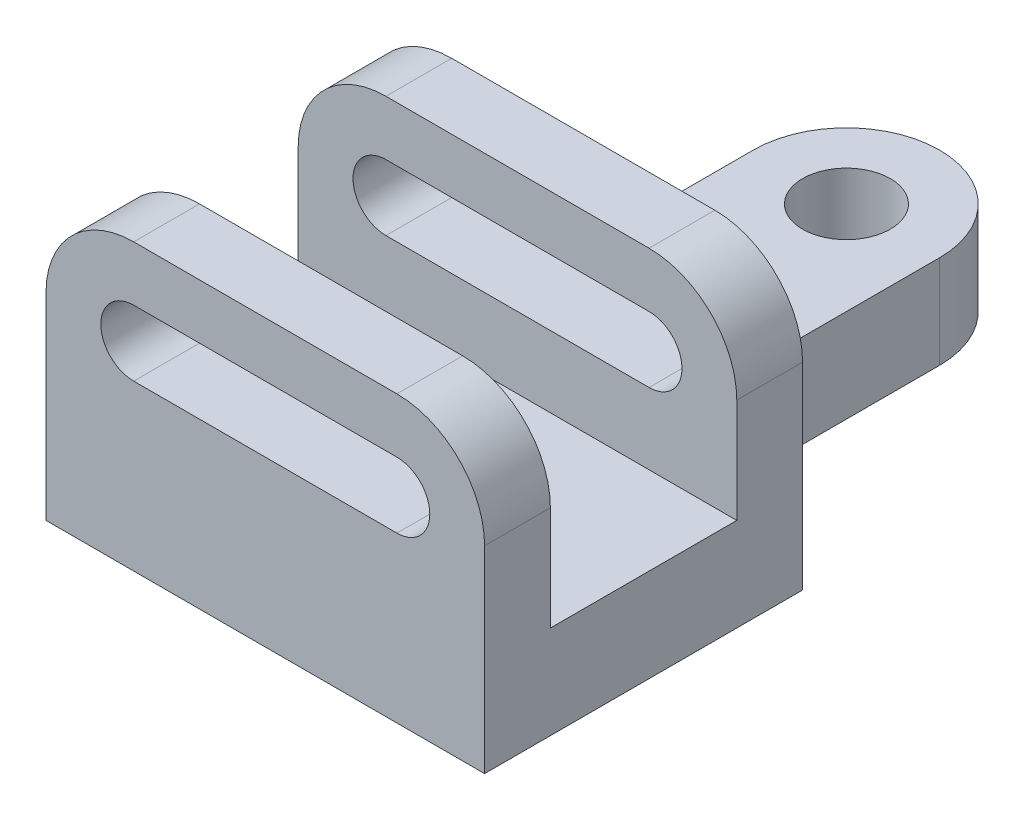
ISO-10303-21;
HEADER;
FILE_DESCRIPTION(('STEP AP214'),'2;1');
FILE_NAME('part.step','',(''),(''),'','','');
FILE_SCHEMA(('AUTOMOTIVE_DESIGN { 1 0 10303 214 1 1 1 1 }'));
ENDSEC;
DATA;
#1=APPLICATION_CONTEXT('core data for automotive mechanical design processes');
#2=APPLICATION_PROTOCOL_DEFINITION('international standard','automotive_design',2000,#1);
#3=PRODUCT_CONTEXT('',#1,'mechanical');
#4=PRODUCT('Part','Part','',(#3));
#5=PRODUCT_RELATED_PRODUCT_CATEGORY('part','',(#4));
#6=PRODUCT_DEFINITION_FORMATION('','',#4);
#7=PRODUCT_DEFINITION_CONTEXT('part definition',#1,'design');
#8=PRODUCT_DEFINITION('design','',#6,#7);
#9=PRODUCT_DEFINITION_SHAPE('','',#8);
#10=(LENGTH_UNIT() NAMED_UNIT(*) SI_UNIT(.MILLI.,.METRE.));
#11=(NAMED_UNIT(*) PLANE_ANGLE_UNIT() SI_UNIT($,.RADIAN.));
#12=(NAMED_UNIT(*) SI_UNIT($,.STERADIAN.) SOLID_ANGLE_UNIT());
#13=UNCERTAINTY_MEASURE_WITH_UNIT(LENGTH_MEASURE(1.E-05),#10,'distance_accuracy_value','');
#14=(GEOMETRIC_REPRESENTATION_CONTEXT(3) GLOBAL_UNCERTAINTY_ASSIGNED_CONTEXT((#13)) GLOBAL_UNIT_ASSIGNED_CONTEXT((#10,
#11,#12)) REPRESENTATION_CONTEXT('',''));
#15=CARTESIAN_POINT('',(0.,0.,0.));
#16=DIRECTION('',(0.,0.,1.));
#17=DIRECTION('',(1.,0.,0.));
#18=AXIS2_PLACEMENT_3D('',#15,#16,#17);
#19=CARTESIAN_POINT('',(-24.,0.,29.));
#20=DIRECTION('',(0.,0.,-1.));
#21=DIRECTION('',(-1.,0.,0.));
#22=AXIS2_PLACEMENT_3D('',#19,#20,#21);
#23=CYLINDRICAL_SURFACE('',#22,16.);
#24=DIRECTION('',(0.,0.,-1.));
#25=VECTOR('',#24,1.);
#26=CARTESIAN_POINT('',(-24.,16.,29.));
#27=LINE('',#26,#25);
#28=CARTESIAN_POINT('',(-24.,16.,29.));
#29=VERTEX_POINT('',#28);
#30=CARTESIAN_POINT('',(-24.,16.,17.));
#31=VERTEX_POINT('',#30);
#32=EDGE_CURVE('E379',#29,#31,#27,.T.);
#33=ORIENTED_EDGE('',*,*,#32,.T.);
#34=CARTESIAN_POINT('',(-24.,0.,17.));
#35=DIRECTION('',(0.,0.,1.));
#36=DIRECTION('',(0.,-1.,0.));
#37=AXIS2_PLACEMENT_3D('',#34,#35,#36);
#38=CIRCLE('',#37,16.);
#39=CARTESIAN_POINT('',(-40.,0.,17.));
#40=VERTEX_POINT('',#39);
#41=EDGE_CURVE('E307',#31,#40,#38,.T.);
#42=ORIENTED_EDGE('',*,*,#41,.T.);
#43=DIRECTION('',(0.,0.,-1.));
#44=VECTOR('',#43,1.);
#45=CARTESIAN_POINT('',(-40.,0.,29.));
#46=LINE('',#45,#44);
#47=CARTESIAN_POINT('',(-40.,0.,29.));
#48=VERTEX_POINT('',#47);
#49=EDGE_CURVE('E397',#48,#40,#46,.T.);
#50=ORIENTED_EDGE('',*,*,#49,.F.);
#51=CARTESIAN_POINT('',(-24.,0.,29.));
#52=DIRECTION('',(0.,0.,1.));
#53=DIRECTION('',(-1.,0.,0.));
#54=AXIS2_PLACEMENT_3D('',#51,#52,#53);
#55=CIRCLE('',#54,16.);
#56=EDGE_CURVE('E348',#29,#48,#55,.T.);
#57=ORIENTED_EDGE('',*,*,#56,.F.);
#58=EDGE_LOOP('',(#33,#42,#50,#57));
#59=FACE_BOUND('',#58,.T.);
#60=ADVANCED_FACE('F33',(#59),#23,.T.);
#61=CARTESIAN_POINT('',(24.,0.,29.));
#62=DIRECTION('',(0.,0.,-1.));
#63=DIRECTION('',(-1.,0.,0.));
#64=AXIS2_PLACEMENT_3D('',#61,#62,#63);
#65=CYLINDRICAL_SURFACE('',#64,16.);
#66=DIRECTION('',(0.,0.,-1.));
#67=VECTOR('',#66,1.);
#68=CARTESIAN_POINT('',(40.,0.,29.));
#69=LINE('',#68,#67);
#70=CARTESIAN_POINT('',(40.,0.,29.));
#71=VERTEX_POINT('',#70);
#72=CARTESIAN_POINT('',(40.,0.,17.));
#73=VERTEX_POINT('',#72);
#74=EDGE_CURVE('E387',#71,#73,#69,.T.);
#75=ORIENTED_EDGE('',*,*,#74,.T.);
#76=CARTESIAN_POINT('',(24.,0.,17.));
#77=DIRECTION('',(0.,0.,1.));
#78=DIRECTION('',(0.,-1.,0.));
#79=AXIS2_PLACEMENT_3D('',#76,#77,#78);
#80=CIRCLE('',#79,16.);
#81=CARTESIAN_POINT('',(24.,16.,17.));
#82=VERTEX_POINT('',#81);
#83=EDGE_CURVE('E304',#73,#82,#80,.T.);
#84=ORIENTED_EDGE('',*,*,#83,.T.);
#85=DIRECTION('',(0.,0.,-1.));
#86=VECTOR('',#85,1.);
#87=CARTESIAN_POINT('',(24.,16.,29.));
#88=LINE('',#87,#86);
#89=CARTESIAN_POINT('',(24.,16.,29.));
#90=VERTEX_POINT('',#89);
#91=EDGE_CURVE('E383',#90,#82,#88,.T.);
#92=ORIENTED_EDGE('',*,*,#91,.F.);
#93=CARTESIAN_POINT('',(24.,0.,29.));
#94=DIRECTION('',(0.,0.,1.));
#95=DIRECTION('',(1.,0.,0.));
#96=AXIS2_PLACEMENT_3D('',#93,#94,#95);
#97=CIRCLE('',#96,16.);
#98=EDGE_CURVE('E358',#71,#90,#97,.T.);
#99=ORIENTED_EDGE('',*,*,#98,.F.);
#100=EDGE_LOOP('',(#75,#84,#92,#99));
#101=FACE_BOUND('',#100,.T.);
#102=ADVANCED_FACE('F441',(#101),#65,.T.);
#103=CARTESIAN_POINT('',(-24.,16.,29.));
#104=DIRECTION('',(0.,-1.,0.));
#105=DIRECTION('',(1.,0.,0.));
#106=AXIS2_PLACEMENT_3D('',#103,#104,#105);
#107=PLANE('',#106);
#108=ORIENTED_EDGE('',*,*,#91,.T.);
#109=DIRECTION('',(1.,0.,0.));
#110=VECTOR('',#109,1.);
#111=CARTESIAN_POINT('',(-40.,16.,17.));
#112=LINE('',#111,#110);
#113=EDGE_CURVE('E280',#31,#82,#112,.T.);
#114=ORIENTED_EDGE('',*,*,#113,.F.);
#115=ORIENTED_EDGE('',*,*,#32,.F.);
#116=DIRECTION('',(-1.,0.,0.));
#117=VECTOR('',#116,1.);
#118=CARTESIAN_POINT('',(-24.,16.,29.));
#119=LINE('',#118,#117);
#120=EDGE_CURVE('E360',#90,#29,#119,.T.);
#121=ORIENTED_EDGE('',*,*,#120,.F.);
#122=EDGE_LOOP('',(#108,#114,#115,#121));
#123=FACE_BOUND('',#122,.T.);
#124=ADVANCED_FACE('F436',(#123),#107,.F.);
#125=CARTESIAN_POINT('',(-24.,0.,29.));
#126=DIRECTION('',(0.,0.,-1.));
#127=DIRECTION('',(-1.,0.,0.));
#128=AXIS2_PLACEMENT_3D('',#125,#126,#127);
#129=CYLINDRICAL_SURFACE('',#128,6.);
#130=CARTESIAN_POINT('',(-24.,0.,17.));
#131=DIRECTION('',(0.,0.,1.));
#132=DIRECTION('',(0.,-1.,0.));
#133=AXIS2_PLACEMENT_3D('',#130,#131,#132);
#134=CIRCLE('',#133,6.);
#135=CARTESIAN_POINT('',(-24.,6.,17.));
#136=VERTEX_POINT('',#135);
#137=CARTESIAN_POINT('',(-24.,-6.,17.));
#138=VERTEX_POINT('',#137);
#139=EDGE_CURVE('E302',#136,#138,#134,.T.);
#140=ORIENTED_EDGE('',*,*,#139,.F.);
#141=DIRECTION('',(0.,0.,-1.));
#142=VECTOR('',#141,1.);
#143=CARTESIAN_POINT('',(-24.,6.,29.));
#144=LINE('',#143,#142);
#145=CARTESIAN_POINT('',(-24.,6.,29.));
#146=VERTEX_POINT('',#145);
#147=EDGE_CURVE('E332',#146,#136,#144,.T.);
#148=ORIENTED_EDGE('',*,*,#147,.F.);
#149=CARTESIAN_POINT('',(-24.,0.,29.));
#150=DIRECTION('',(0.,0.,1.));
#151=DIRECTION('',(1.,0.,0.));
#152=AXIS2_PLACEMENT_3D('',#149,#150,#151);
#153=CIRCLE('',#152,6.);
#154=CARTESIAN_POINT('',(-24.,-6.,29.));
#155=VERTEX_POINT('',#154);
#156=EDGE_CURVE('E311',#146,#155,#153,.T.);
#157=ORIENTED_EDGE('',*,*,#156,.T.);
#158=DIRECTION('',(0.,0.,-1.));
#159=VECTOR('',#158,1.);
#160=CARTESIAN_POINT('',(-24.,-6.,29.));
#161=LINE('',#160,#159);
#162=EDGE_CURVE('E344',#155,#138,#161,.T.);
#163=ORIENTED_EDGE('',*,*,#162,.T.);
#164=EDGE_LOOP('',(#140,#148,#157,#163));
#165=FACE_BOUND('',#164,.T.);
#166=ADVANCED_FACE('F426',(#165),#129,.F.);
#167=CARTESIAN_POINT('',(-24.,-6.,29.));
#168=DIRECTION('',(0.,1.,0.));
#169=DIRECTION('',(0.,0.,1.));
#170=AXIS2_PLACEMENT_3D('',#167,#168,#169);
#171=PLANE('',#170);
#172=DIRECTION('',(1.,0.,0.));
#173=VECTOR('',#172,1.);
#174=CARTESIAN_POINT('',(-24.,-6.,17.));
#175=LINE('',#174,#173);
#176=CARTESIAN_POINT('',(24.,-6.,17.));
#177=VERTEX_POINT('',#176);
#178=EDGE_CURVE('E300',#138,#177,#175,.T.);
#179=ORIENTED_EDGE('',*,*,#178,.F.);
#180=ORIENTED_EDGE('',*,*,#162,.F.);
#181=DIRECTION('',(1.,0.,0.));
#182=VECTOR('',#181,1.);
#183=CARTESIAN_POINT('',(-24.,-6.,29.));
#184=LINE('',#183,#182);
#185=CARTESIAN_POINT('',(24.,-6.,29.));
#186=VERTEX_POINT('',#185);
#187=EDGE_CURVE('E313',#155,#186,#184,.T.);
#188=ORIENTED_EDGE('',*,*,#187,.T.);
#189=DIRECTION('',(0.,0.,-1.));
#190=VECTOR('',#189,1.);
#191=CARTESIAN_POINT('',(24.,-6.,29.));
#192=LINE('',#191,#190);
#193=EDGE_CURVE('E340',#186,#177,#192,.T.);
#194=ORIENTED_EDGE('',*,*,#193,.T.);
#195=EDGE_LOOP('',(#179,#180,#188,#194));
#196=FACE_BOUND('',#195,.T.);
#197=ADVANCED_FACE('F432',(#196),#171,.T.);
#198=CARTESIAN_POINT('',(24.,0.,29.));
#199=DIRECTION('',(0.,0.,-1.));
#200=DIRECTION('',(-1.,0.,0.));
#201=AXIS2_PLACEMENT_3D('',#198,#199,#200);
#202=CYLINDRICAL_SURFACE('',#201,6.);
#203=CARTESIAN_POINT('',(24.,0.,17.));
#204=DIRECTION('',(0.,0.,1.));
#205=DIRECTION('',(0.,-1.,0.));
#206=AXIS2_PLACEMENT_3D('',#203,#204,#205);
#207=CIRCLE('',#206,6.);
#208=CARTESIAN_POINT('',(24.,6.,17.));
#209=VERTEX_POINT('',#208);
#210=EDGE_CURVE('E298',#177,#209,#207,.T.);
#211=ORIENTED_EDGE('',*,*,#210,.F.);
#212=ORIENTED_EDGE('',*,*,#193,.F.);
#213=CARTESIAN_POINT('',(24.,0.,29.));
#214=DIRECTION('',(0.,0.,1.));
#215=DIRECTION('',(1.,0.,0.));
#216=AXIS2_PLACEMENT_3D('',#213,#214,#215);
#217=CIRCLE('',#216,6.);
#218=CARTESIAN_POINT('',(24.,6.,29.));
#219=VERTEX_POINT('',#218);
#220=EDGE_CURVE('E316',#186,#219,#217,.T.);
#221=ORIENTED_EDGE('',*,*,#220,.T.);
#222=DIRECTION('',(0.,0.,-1.));
#223=VECTOR('',#222,1.);
#224=CARTESIAN_POINT('',(24.,6.,29.));
#225=LINE('',#224,#223);
#226=EDGE_CURVE('E336',#219,#209,#225,.T.);
#227=ORIENTED_EDGE('',*,*,#226,.T.);
#228=EDGE_LOOP('',(#211,#212,#221,#227));
#229=FACE_BOUND('',#228,.T.);
#230=ADVANCED_FACE('F533',(#229),#202,.F.);
#231=CARTESIAN_POINT('',(-24.,6.,29.));
#232=DIRECTION('',(0.,-1.,0.));
#233=DIRECTION('',(0.,0.,-1.));
#234=AXIS2_PLACEMENT_3D('',#231,#232,#233);
#235=PLANE('',#234);
#236=DIRECTION('',(-1.,0.,0.));
#237=VECTOR('',#236,1.);
#238=CARTESIAN_POINT('',(-24.,6.,17.));
#239=LINE('',#238,#237);
#240=EDGE_CURVE('E11',#209,#136,#239,.T.);
#241=ORIENTED_EDGE('',*,*,#240,.F.);
#242=ORIENTED_EDGE('',*,*,#226,.F.);
#243=DIRECTION('',(-1.,0.,0.));
#244=VECTOR('',#243,1.);
#245=CARTESIAN_POINT('',(-24.,6.,29.));
#246=LINE('',#245,#244);
#247=EDGE_CURVE('E319',#219,#146,#246,.T.);
#248=ORIENTED_EDGE('',*,*,#247,.T.);
#249=ORIENTED_EDGE('',*,*,#147,.T.);
#250=EDGE_LOOP('',(#241,#242,#248,#249));
#251=FACE_BOUND('',#250,.T.);
#252=ADVANCED_FACE('F531',(#251),#235,.T.);
#253=CARTESIAN_POINT('',(-24.,0.,29.));
#254=DIRECTION('',(0.,0.,-1.));
#255=DIRECTION('',(-1.,0.,0.));
#256=AXIS2_PLACEMENT_3D('',#253,#254,#255);
#257=PLANE('',#256);
#258=ORIENTED_EDGE('',*,*,#56,.T.);
#259=DIRECTION('',(0.,-1.,0.));
#260=VECTOR('',#259,1.);
#261=CARTESIAN_POINT('',(-40.,0.,29.));
#262=LINE('',#261,#260);
#263=CARTESIAN_POINT('',(-40.,-36.,29.));
#264=VERTEX_POINT('',#263);
#265=EDGE_CURVE('E351',#48,#264,#262,.T.);
#266=ORIENTED_EDGE('',*,*,#265,.T.);
#267=DIRECTION('',(1.,0.,0.));
#268=VECTOR('',#267,1.);
#269=CARTESIAN_POINT('',(-40.,-36.,29.));
#270=LINE('',#269,#268);
#271=CARTESIAN_POINT('',(40.,-36.,29.));
#272=VERTEX_POINT('',#271);
#273=EDGE_CURVE('E354',#264,#272,#270,.T.);
#274=ORIENTED_EDGE('',*,*,#273,.T.);
#275=DIRECTION('',(0.,1.,0.));
#276=VECTOR('',#275,1.);
#277=CARTESIAN_POINT('',(40.,-36.,29.));
#278=LINE('',#277,#276);
#279=EDGE_CURVE('E356',#272,#71,#278,.T.);
#280=ORIENTED_EDGE('',*,*,#279,.T.);
#281=ORIENTED_EDGE('',*,*,#98,.T.);
#282=ORIENTED_EDGE('',*,*,#120,.T.);
#283=EDGE_LOOP('',(#258,#266,#274,#280,#281,#282));
#284=FACE_BOUND('',#283,.T.);
#285=ORIENTED_EDGE('',*,*,#156,.F.);
#286=ORIENTED_EDGE('',*,*,#247,.F.);
#287=ORIENTED_EDGE('',*,*,#220,.F.);
#288=ORIENTED_EDGE('',*,*,#187,.F.);
#289=EDGE_LOOP('',(#285,#286,#287,#288));
#290=FACE_BOUND('',#289,.T.);
#291=ADVANCED_FACE('F457',(#284,#290),#257,.F.);
#292=CARTESIAN_POINT('',(-24.,0.,-29.));
#293=DIRECTION('',(0.,0.,-1.));
#294=DIRECTION('',(-1.,0.,0.));
#295=AXIS2_PLACEMENT_3D('',#292,#293,#294);
#296=PLANE('',#295);
#297=DIRECTION('',(0.,-1.,0.));
#298=VECTOR('',#297,1.);
#299=CARTESIAN_POINT('',(-33.0000000000001,-19.,-29.));
#300=LINE('',#299,#298);
#301=CARTESIAN_POINT('',(-33.0000000000001,-19.,-29.));
#302=VERTEX_POINT('',#301);
#303=CARTESIAN_POINT('',(-33.0000000000001,-36.,-29.));
#304=VERTEX_POINT('',#303);
#305=EDGE_CURVE('E258',#302,#304,#300,.T.);
#306=ORIENTED_EDGE('',*,*,#305,.T.);
#307=DIRECTION('',(1.,0.,0.));
#308=VECTOR('',#307,1.);
#309=CARTESIAN_POINT('',(-40.,-36.,-29.));
#310=LINE('',#309,#308);
#311=CARTESIAN_POINT('',(-40.,-36.,-29.));
#312=VERTEX_POINT('',#311);
#313=EDGE_CURVE('E368',#312,#304,#310,.T.);
#314=ORIENTED_EDGE('',*,*,#313,.F.);
#315=DIRECTION('',(0.,-1.,0.));
#316=VECTOR('',#315,1.);
#317=CARTESIAN_POINT('',(-40.,0.,-29.));
#318=LINE('',#317,#316);
#319=CARTESIAN_POINT('',(-40.,0.,-29.));
#320=VERTEX_POINT('',#319);
#321=EDGE_CURVE('E365',#320,#312,#318,.T.);
#322=ORIENTED_EDGE('',*,*,#321,.F.);
#323=CARTESIAN_POINT('',(-24.,0.,-29.));
#324=DIRECTION('',(0.,0.,1.));
#325=DIRECTION('',(-1.,0.,0.));
#326=AXIS2_PLACEMENT_3D('',#323,#324,#325);
#327=CIRCLE('',#326,16.);
#328=CARTESIAN_POINT('',(-24.,16.,-29.));
#329=VERTEX_POINT('',#328);
#330=EDGE_CURVE('E347',#329,#320,#327,.T.);
#331=ORIENTED_EDGE('',*,*,#330,.F.);
#332=DIRECTION('',(-1.,0.,0.));
#333=VECTOR('',#332,1.);
#334=CARTESIAN_POINT('',(-24.,16.,-29.));
#335=LINE('',#334,#333);
#336=CARTESIAN_POINT('',(24.,16.,-29.));
#337=VERTEX_POINT('',#336);
#338=EDGE_CURVE('E352',#337,#329,#335,.T.);
#339=ORIENTED_EDGE('',*,*,#338,.F.);
#340=CARTESIAN_POINT('',(24.,0.,-29.));
#341=DIRECTION('',(0.,0.,1.));
#342=DIRECTION('',(1.,0.,0.));
#343=AXIS2_PLACEMENT_3D('',#340,#341,#342);
#344=CIRCLE('',#343,16.);
#345=CARTESIAN_POINT('',(40.,0.,-29.));
#346=VERTEX_POINT('',#345);
#347=EDGE_CURVE('E374',#346,#337,#344,.T.);
#348=ORIENTED_EDGE('',*,*,#347,.F.);
#349=DIRECTION('',(0.,1.,0.));
#350=VECTOR('',#349,1.);
#351=CARTESIAN_POINT('',(40.,-36.,-29.));
#352=LINE('',#351,#350);
#353=CARTESIAN_POINT('',(40.,-36.,-29.));
#354=VERTEX_POINT('',#353);
#355=EDGE_CURVE('E371',#354,#346,#352,.T.);
#356=ORIENTED_EDGE('',*,*,#355,.F.);
#357=CARTESIAN_POINT('',(33.,-36.,-29.));
#358=VERTEX_POINT('',#357);
#359=EDGE_CURVE('E367',#358,#354,#310,.T.);
#360=ORIENTED_EDGE('',*,*,#359,.F.);
#361=DIRECTION('',(0.,-1.,0.));
#362=VECTOR('',#361,1.);
#363=CARTESIAN_POINT('',(33.0000000000001,-19.,-29.));
#364=LINE('',#363,#362);
#365=CARTESIAN_POINT('',(33.0000000000001,-19.,-29.));
#366=VERTEX_POINT('',#365);
#367=EDGE_CURVE('E261',#366,#358,#364,.T.);
#368=ORIENTED_EDGE('',*,*,#367,.F.);
#369=DIRECTION('',(-1.,0.,0.));
#370=VECTOR('',#369,1.);
#371=CARTESIAN_POINT('',(-33.0000000000001,-19.,-29.));
#372=LINE('',#371,#370);
#373=EDGE_CURVE('E240',#366,#302,#372,.T.);
#374=ORIENTED_EDGE('',*,*,#373,.T.);
#375=EDGE_LOOP('',(#306,#314,#322,#331,#339,#348,#356,#360,#368,#374));
#376=FACE_BOUND('',#375,.T.);
#377=DIRECTION('',(-1.,0.,0.));
#378=VECTOR('',#377,1.);
#379=CARTESIAN_POINT('',(-24.,6.,-29.));
#380=LINE('',#379,#378);
#381=CARTESIAN_POINT('',(24.,6.,-29.));
#382=VERTEX_POINT('',#381);
#383=CARTESIAN_POINT('',(-24.,6.,-29.));
#384=VERTEX_POINT('',#383);
#385=EDGE_CURVE('E314',#382,#384,#380,.T.);
#386=ORIENTED_EDGE('',*,*,#385,.T.);
#387=CARTESIAN_POINT('',(-24.,0.,-29.));
#388=DIRECTION('',(0.,0.,1.));
#389=DIRECTION('',(1.,0.,0.));
#390=AXIS2_PLACEMENT_3D('',#387,#388,#389);
#391=CIRCLE('',#390,6.);
#392=CARTESIAN_POINT('',(-24.,-6.,-29.));
#393=VERTEX_POINT('',#392);
#394=EDGE_CURVE('E310',#384,#393,#391,.T.);
#395=ORIENTED_EDGE('',*,*,#394,.T.);
#396=DIRECTION('',(1.,0.,0.));
#397=VECTOR('',#396,1.);
#398=CARTESIAN_POINT('',(-24.,-6.,-29.));
#399=LINE('',#398,#397);
#400=CARTESIAN_POINT('',(24.,-6.,-29.));
#401=VERTEX_POINT('',#400);
#402=EDGE_CURVE('E324',#393,#401,#399,.T.);
#403=ORIENTED_EDGE('',*,*,#402,.T.);
#404=CARTESIAN_POINT('',(24.,0.,-29.));
#405=DIRECTION('',(0.,0.,1.));
#406=DIRECTION('',(1.,0.,0.));
#407=AXIS2_PLACEMENT_3D('',#404,#405,#406);
#408=CIRCLE('',#407,6.);
#409=EDGE_CURVE('E327',#401,#382,#408,.T.);
#410=ORIENTED_EDGE('',*,*,#409,.T.);
#411=EDGE_LOOP('',(#386,#395,#403,#410));
#412=FACE_BOUND('',#411,.T.);
#413=ADVANCED_FACE('F416',(#376,#412),#296,.T.);
#414=CARTESIAN_POINT('',(-40.,0.,-17.));
#415=VERTEX_POINT('',#414);
#416=EDGE_CURVE('E396',#415,#320,#46,.T.);
#417=ORIENTED_EDGE('',*,*,#416,.F.);
#418=CARTESIAN_POINT('',(-24.,0.,-17.));
#419=DIRECTION('',(0.,0.,-1.));
#420=DIRECTION('',(0.,1.,0.));
#421=AXIS2_PLACEMENT_3D('',#418,#419,#420);
#422=CIRCLE('',#421,16.);
#423=CARTESIAN_POINT('',(-24.,16.,-17.));
#424=VERTEX_POINT('',#423);
#425=EDGE_CURVE('E295',#415,#424,#422,.T.);
#426=ORIENTED_EDGE('',*,*,#425,.T.);
#427=EDGE_CURVE('E362',#424,#329,#27,.T.);
#428=ORIENTED_EDGE('',*,*,#427,.T.);
#429=ORIENTED_EDGE('',*,*,#330,.T.);
#430=EDGE_LOOP('',(#417,#426,#428,#429));
#431=FACE_BOUND('',#430,.T.);
#432=ADVANCED_FACE('F35',(#431),#23,.T.);
#433=CARTESIAN_POINT('',(-40.,0.,29.));
#434=DIRECTION('',(1.,0.,0.));
#435=DIRECTION('',(0.,0.,-1.));
#436=AXIS2_PLACEMENT_3D('',#433,#434,#435);
#437=PLANE('',#436);
#438=ORIENTED_EDGE('',*,*,#49,.T.);
#439=DIRECTION('',(0.,-1.,0.));
#440=VECTOR('',#439,1.);
#441=CARTESIAN_POINT('',(-40.,16.,17.));
#442=LINE('',#441,#440);
#443=CARTESIAN_POINT('',(-40.,-19.,17.));
#444=VERTEX_POINT('',#443);
#445=EDGE_CURVE('E270',#40,#444,#442,.T.);
#446=ORIENTED_EDGE('',*,*,#445,.T.);
#447=DIRECTION('',(0.,0.,-1.));
#448=VECTOR('',#447,1.);
#449=CARTESIAN_POINT('',(-40.,-19.,17.));
#450=LINE('',#449,#448);
#451=CARTESIAN_POINT('',(-40.,-19.,-17.));
#452=VERTEX_POINT('',#451);
#453=EDGE_CURVE('E273',#444,#452,#450,.T.);
#454=ORIENTED_EDGE('',*,*,#453,.T.);
#455=DIRECTION('',(0.,1.,0.));
#456=VECTOR('',#455,1.);
#457=CARTESIAN_POINT('',(-40.,16.,-17.));
#458=LINE('',#457,#456);
#459=EDGE_CURVE('E276',#452,#415,#458,.T.);
#460=ORIENTED_EDGE('',*,*,#459,.T.);
#461=ORIENTED_EDGE('',*,*,#416,.T.);
#462=ORIENTED_EDGE('',*,*,#321,.T.);
#463=DIRECTION('',(0.,0.,-1.));
#464=VECTOR('',#463,1.);
#465=CARTESIAN_POINT('',(-40.,-36.,29.));
#466=LINE('',#465,#464);
#467=EDGE_CURVE('E393',#264,#312,#466,.T.);
#468=ORIENTED_EDGE('',*,*,#467,.F.);
#469=ORIENTED_EDGE('',*,*,#265,.F.);
#470=EDGE_LOOP('',(#438,#446,#454,#460,#461,#462,#468,#469));
#471=FACE_BOUND('',#470,.T.);
#472=ADVANCED_FACE('F449',(#471),#437,.F.);
#473=CARTESIAN_POINT('',(-40.,-36.,29.));
#474=DIRECTION('',(0.,1.,0.));
#475=DIRECTION('',(0.,0.,1.));
#476=AXIS2_PLACEMENT_3D('',#473,#474,#475);
#477=PLANE('',#476);
#478=ORIENTED_EDGE('',*,*,#313,.T.);
#479=CARTESIAN_POINT('',(-33.,-36.,-45.));
#480=DIRECTION('',(0.,1.,0.));
#481=DIRECTION('',(0.,0.,-1.));
#482=AXIS2_PLACEMENT_3D('',#479,#480,#481);
#483=CIRCLE('',#482,16.);
#484=CARTESIAN_POINT('',(-17.,-36.,-45.0000000000001));
#485=VERTEX_POINT('',#484);
#486=EDGE_CURVE('E233',#304,#485,#483,.T.);
#487=ORIENTED_EDGE('',*,*,#486,.T.);
#488=DIRECTION('',(0.,0.,-1.));
#489=VECTOR('',#488,1.);
#490=CARTESIAN_POINT('',(-17.,-36.,-77.));
#491=LINE('',#490,#489);
#492=CARTESIAN_POINT('',(-17.,-36.,-77.));
#493=VERTEX_POINT('',#492);
#494=EDGE_CURVE('E230',#485,#493,#491,.T.);
#495=ORIENTED_EDGE('',*,*,#494,.T.);
#496=CARTESIAN_POINT('',(0.,-36.,-77.));
#497=DIRECTION('',(0.,-1.,0.));
#498=DIRECTION('',(0.,0.,-1.));
#499=AXIS2_PLACEMENT_3D('',#496,#497,#498);
#500=CIRCLE('',#499,17.);
#501=CARTESIAN_POINT('',(17.,-36.,-77.));
#502=VERTEX_POINT('',#501);
#503=EDGE_CURVE('E247',#493,#502,#500,.T.);
#504=ORIENTED_EDGE('',*,*,#503,.T.);
#505=DIRECTION('',(0.,0.,1.));
#506=VECTOR('',#505,1.);
#507=CARTESIAN_POINT('',(17.,-36.,-77.));
#508=LINE('',#507,#506);
#509=CARTESIAN_POINT('',(17.,-36.,-45.0000000000001));
#510=VERTEX_POINT('',#509);
#511=EDGE_CURVE('E210',#502,#510,#508,.T.);
#512=ORIENTED_EDGE('',*,*,#511,.T.);
#513=CARTESIAN_POINT('',(33.,-36.,-45.));
#514=DIRECTION('',(0.,1.,0.));
#515=DIRECTION('',(0.,0.,-1.));
#516=AXIS2_PLACEMENT_3D('',#513,#514,#515);
#517=CIRCLE('',#516,16.);
#518=EDGE_CURVE('E48',#510,#358,#517,.T.);
#519=ORIENTED_EDGE('',*,*,#518,.T.);
#520=ORIENTED_EDGE('',*,*,#359,.T.);
#521=DIRECTION('',(0.,0.,-1.));
#522=VECTOR('',#521,1.);
#523=CARTESIAN_POINT('',(40.,-36.,29.));
#524=LINE('',#523,#522);
#525=EDGE_CURVE('E390',#272,#354,#524,.T.);
#526=ORIENTED_EDGE('',*,*,#525,.F.);
#527=ORIENTED_EDGE('',*,*,#273,.F.);
#528=ORIENTED_EDGE('',*,*,#467,.T.);
#529=EDGE_LOOP('',(#478,#487,#495,#504,#512,#519,#520,#526,#527,#528));
#530=FACE_BOUND('',#529,.T.);
#531=CARTESIAN_POINT('',(0.,-36.,-77.));
#532=DIRECTION('',(0.,-1.,0.));
#533=DIRECTION('',(0.,0.,-1.));
#534=AXIS2_PLACEMENT_3D('',#531,#532,#533);
#535=CIRCLE('',#534,8.);
#536=CARTESIAN_POINT('',(0.,-36.,-85.));
#537=VERTEX_POINT('',#536);
#538=EDGE_CURVE('E236',#537,#537,#535,.T.);
#539=ORIENTED_EDGE('',*,*,#538,.F.);
#540=EDGE_LOOP('',(#539));
#541=FACE_BOUND('',#540,.T.);
#542=ADVANCED_FACE('F455',(#530,#541),#477,.F.);
#543=CARTESIAN_POINT('',(40.,-36.,29.));
#544=DIRECTION('',(-1.,0.,0.));
#545=DIRECTION('',(0.,0.,1.));
#546=AXIS2_PLACEMENT_3D('',#543,#544,#545);
#547=PLANE('',#546);
#548=DIRECTION('',(0.,0.,-1.));
#549=VECTOR('',#548,1.);
#550=CARTESIAN_POINT('',(40.,-19.,17.));
#551=LINE('',#550,#549);
#552=CARTESIAN_POINT('',(40.,-19.,17.));
#553=VERTEX_POINT('',#552);
#554=CARTESIAN_POINT('',(40.,-19.,-17.));
#555=VERTEX_POINT('',#554);
#556=EDGE_CURVE('E265',#553,#555,#551,.T.);
#557=ORIENTED_EDGE('',*,*,#556,.F.);
#558=DIRECTION('',(0.,-1.,0.));
#559=VECTOR('',#558,1.);
#560=CARTESIAN_POINT('',(40.,16.,17.));
#561=LINE('',#560,#559);
#562=EDGE_CURVE('E255',#73,#553,#561,.T.);
#563=ORIENTED_EDGE('',*,*,#562,.F.);
#564=ORIENTED_EDGE('',*,*,#74,.F.);
#565=ORIENTED_EDGE('',*,*,#279,.F.);
#566=ORIENTED_EDGE('',*,*,#525,.T.);
#567=ORIENTED_EDGE('',*,*,#355,.T.);
#568=CARTESIAN_POINT('',(40.,0.,-17.));
#569=VERTEX_POINT('',#568);
#570=EDGE_CURVE('E386',#569,#346,#69,.T.);
#571=ORIENTED_EDGE('',*,*,#570,.F.);
#572=DIRECTION('',(0.,1.,0.));
#573=VECTOR('',#572,1.);
#574=CARTESIAN_POINT('',(40.,16.,-17.));
#575=LINE('',#574,#573);
#576=EDGE_CURVE('E268',#555,#569,#575,.T.);
#577=ORIENTED_EDGE('',*,*,#576,.F.);
#578=EDGE_LOOP('',(#557,#563,#564,#565,#566,#567,#571,#577));
#579=FACE_BOUND('',#578,.T.);
#580=ADVANCED_FACE('F488',(#579),#547,.F.);
#581=CARTESIAN_POINT('',(24.,16.,-17.));
#582=VERTEX_POINT('',#581);
#583=EDGE_CURVE('E382',#582,#337,#88,.T.);
#584=ORIENTED_EDGE('',*,*,#583,.F.);
#585=CARTESIAN_POINT('',(24.,0.,-17.));
#586=DIRECTION('',(0.,0.,-1.));
#587=DIRECTION('',(0.,1.,0.));
#588=AXIS2_PLACEMENT_3D('',#585,#586,#587);
#589=CIRCLE('',#588,16.);
#590=EDGE_CURVE('E56',#582,#569,#589,.T.);
#591=ORIENTED_EDGE('',*,*,#590,.T.);
#592=ORIENTED_EDGE('',*,*,#570,.T.);
#593=ORIENTED_EDGE('',*,*,#347,.T.);
#594=EDGE_LOOP('',(#584,#591,#592,#593));
#595=FACE_BOUND('',#594,.T.);
#596=ADVANCED_FACE('F433',(#595),#65,.T.);
#597=ORIENTED_EDGE('',*,*,#427,.F.);
#598=DIRECTION('',(1.,0.,0.));
#599=VECTOR('',#598,1.);
#600=CARTESIAN_POINT('',(-40.,16.,-17.));
#601=LINE('',#600,#599);
#602=EDGE_CURVE('E283',#424,#582,#601,.T.);
#603=ORIENTED_EDGE('',*,*,#602,.T.);
#604=ORIENTED_EDGE('',*,*,#583,.T.);
#605=ORIENTED_EDGE('',*,*,#338,.T.);
#606=EDGE_LOOP('',(#597,#603,#604,#605));
#607=FACE_BOUND('',#606,.T.);
#608=ADVANCED_FACE('F424',(#607),#107,.F.);
#609=CARTESIAN_POINT('',(-24.,0.,-17.));
#610=DIRECTION('',(0.,0.,-1.));
#611=DIRECTION('',(0.,1.,0.));
#612=AXIS2_PLACEMENT_3D('',#609,#610,#611);
#613=CIRCLE('',#612,6.);
#614=CARTESIAN_POINT('',(-24.,-6.,-17.));
#615=VERTEX_POINT('',#614);
#616=CARTESIAN_POINT('',(-24.,6.,-17.));
#617=VERTEX_POINT('',#616);
#618=EDGE_CURVE('E292',#615,#617,#613,.T.);
#619=ORIENTED_EDGE('',*,*,#618,.F.);
#620=EDGE_CURVE('E343',#615,#393,#161,.T.);
#621=ORIENTED_EDGE('',*,*,#620,.T.);
#622=ORIENTED_EDGE('',*,*,#394,.F.);
#623=EDGE_CURVE('E321',#617,#384,#144,.T.);
#624=ORIENTED_EDGE('',*,*,#623,.F.);
#625=EDGE_LOOP('',(#619,#621,#622,#624));
#626=FACE_BOUND('',#625,.T.);
#627=ADVANCED_FACE('F422',(#626),#129,.F.);
#628=DIRECTION('',(-1.,0.,0.));
#629=VECTOR('',#628,1.);
#630=CARTESIAN_POINT('',(-24.,-6.,-17.));
#631=LINE('',#630,#629);
#632=CARTESIAN_POINT('',(24.,-6.,-17.));
#633=VERTEX_POINT('',#632);
#634=EDGE_CURVE('E290',#633,#615,#631,.T.);
#635=ORIENTED_EDGE('',*,*,#634,.F.);
#636=EDGE_CURVE('E339',#633,#401,#192,.T.);
#637=ORIENTED_EDGE('',*,*,#636,.T.);
#638=ORIENTED_EDGE('',*,*,#402,.F.);
#639=ORIENTED_EDGE('',*,*,#620,.F.);
#640=EDGE_LOOP('',(#635,#637,#638,#639));
#641=FACE_BOUND('',#640,.T.);
#642=ADVANCED_FACE('F420',(#641),#171,.T.);
#643=CARTESIAN_POINT('',(24.,0.,-17.));
#644=DIRECTION('',(0.,0.,-1.));
#645=DIRECTION('',(0.,1.,0.));
#646=AXIS2_PLACEMENT_3D('',#643,#644,#645);
#647=CIRCLE('',#646,6.);
#648=CARTESIAN_POINT('',(24.,6.,-17.));
#649=VERTEX_POINT('',#648);
#650=EDGE_CURVE('E282',#649,#633,#647,.T.);
#651=ORIENTED_EDGE('',*,*,#650,.F.);
#652=EDGE_CURVE('E335',#649,#382,#225,.T.);
#653=ORIENTED_EDGE('',*,*,#652,.T.);
#654=ORIENTED_EDGE('',*,*,#409,.F.);
#655=ORIENTED_EDGE('',*,*,#636,.F.);
#656=EDGE_LOOP('',(#651,#653,#654,#655));
#657=FACE_BOUND('',#656,.T.);
#658=ADVANCED_FACE('F410',(#657),#202,.F.);
#659=DIRECTION('',(1.,0.,0.));
#660=VECTOR('',#659,1.);
#661=CARTESIAN_POINT('',(-24.,6.,-17.));
#662=LINE('',#661,#660);
#663=EDGE_CURVE('E41',#617,#649,#662,.T.);
#664=ORIENTED_EDGE('',*,*,#663,.F.);
#665=ORIENTED_EDGE('',*,*,#623,.T.);
#666=ORIENTED_EDGE('',*,*,#385,.F.);
#667=ORIENTED_EDGE('',*,*,#652,.F.);
#668=EDGE_LOOP('',(#664,#665,#666,#667));
#669=FACE_BOUND('',#668,.T.);
#670=ADVANCED_FACE('F413',(#669),#235,.T.);
#671=CARTESIAN_POINT('',(-40.,16.,17.));
#672=DIRECTION('',(0.,0.,1.));
#673=DIRECTION('',(0.,-1.,0.));
#674=AXIS2_PLACEMENT_3D('',#671,#672,#673);
#675=PLANE('',#674);
#676=ORIENTED_EDGE('',*,*,#139,.T.);
#677=ORIENTED_EDGE('',*,*,#178,.T.);
#678=ORIENTED_EDGE('',*,*,#210,.T.);
#679=ORIENTED_EDGE('',*,*,#240,.T.);
#680=EDGE_LOOP('',(#676,#677,#678,#679));
#681=FACE_BOUND('',#680,.T.);
#682=ORIENTED_EDGE('',*,*,#113,.T.);
#683=ORIENTED_EDGE('',*,*,#83,.F.);
#684=ORIENTED_EDGE('',*,*,#562,.T.);
#685=DIRECTION('',(1.,0.,0.));
#686=VECTOR('',#685,1.);
#687=CARTESIAN_POINT('',(-40.,-19.,17.));
#688=LINE('',#687,#686);
#689=EDGE_CURVE('E279',#444,#553,#688,.T.);
#690=ORIENTED_EDGE('',*,*,#689,.F.);
#691=ORIENTED_EDGE('',*,*,#445,.F.);
#692=ORIENTED_EDGE('',*,*,#41,.F.);
#693=EDGE_LOOP('',(#682,#683,#684,#690,#691,#692));
#694=FACE_BOUND('',#693,.T.);
#695=ADVANCED_FACE('F480',(#681,#694),#675,.F.);
#696=CARTESIAN_POINT('',(-40.,16.,-17.));
#697=DIRECTION('',(0.,0.,-1.));
#698=DIRECTION('',(0.,1.,0.));
#699=AXIS2_PLACEMENT_3D('',#696,#697,#698);
#700=PLANE('',#699);
#701=ORIENTED_EDGE('',*,*,#618,.T.);
#702=ORIENTED_EDGE('',*,*,#663,.T.);
#703=ORIENTED_EDGE('',*,*,#650,.T.);
#704=ORIENTED_EDGE('',*,*,#634,.T.);
#705=EDGE_LOOP('',(#701,#702,#703,#704));
#706=FACE_BOUND('',#705,.T.);
#707=ORIENTED_EDGE('',*,*,#459,.F.);
#708=DIRECTION('',(1.,0.,0.));
#709=VECTOR('',#708,1.);
#710=CARTESIAN_POINT('',(-40.,-19.,-17.));
#711=LINE('',#710,#709);
#712=EDGE_CURVE('E285',#452,#555,#711,.T.);
#713=ORIENTED_EDGE('',*,*,#712,.T.);
#714=ORIENTED_EDGE('',*,*,#576,.T.);
#715=ORIENTED_EDGE('',*,*,#590,.F.);
#716=ORIENTED_EDGE('',*,*,#602,.F.);
#717=ORIENTED_EDGE('',*,*,#425,.F.);
#718=EDGE_LOOP('',(#707,#713,#714,#715,#716,#717));
#719=FACE_BOUND('',#718,.T.);
#720=ADVANCED_FACE('F402',(#706,#719),#700,.F.);
#721=CARTESIAN_POINT('',(-40.,-19.,17.));
#722=DIRECTION('',(0.,-1.,0.));
#723=DIRECTION('',(0.,0.,-1.));
#724=AXIS2_PLACEMENT_3D('',#721,#722,#723);
#725=PLANE('',#724);
#726=ORIENTED_EDGE('',*,*,#712,.F.);
#727=ORIENTED_EDGE('',*,*,#453,.F.);
#728=ORIENTED_EDGE('',*,*,#689,.T.);
#729=ORIENTED_EDGE('',*,*,#556,.T.);
#730=EDGE_LOOP('',(#726,#727,#728,#729));
#731=FACE_BOUND('',#730,.T.);
#732=ADVANCED_FACE('F493',(#731),#725,.F.);
#733=CARTESIAN_POINT('',(0.,-19.,-77.));
#734=DIRECTION('',(0.,-1.,0.));
#735=DIRECTION('',(0.,0.,-1.));
#736=AXIS2_PLACEMENT_3D('',#733,#734,#735);
#737=CYLINDRICAL_SURFACE('',#736,17.);
#738=ORIENTED_EDGE('',*,*,#503,.F.);
#739=DIRECTION('',(0.,-1.,0.));
#740=VECTOR('',#739,1.);
#741=CARTESIAN_POINT('',(-17.,-19.,-77.));
#742=LINE('',#741,#740);
#743=CARTESIAN_POINT('',(-17.,-19.,-77.));
#744=VERTEX_POINT('',#743);
#745=EDGE_CURVE('E229',#744,#493,#742,.T.);
#746=ORIENTED_EDGE('',*,*,#745,.F.);
#747=CARTESIAN_POINT('',(0.,-19.,-77.));
#748=DIRECTION('',(0.,-1.,0.));
#749=DIRECTION('',(0.,0.,-1.));
#750=AXIS2_PLACEMENT_3D('',#747,#748,#749);
#751=CIRCLE('',#750,17.);
#752=CARTESIAN_POINT('',(17.,-19.,-77.));
#753=VERTEX_POINT('',#752);
#754=EDGE_CURVE('E223',#744,#753,#751,.T.);
#755=ORIENTED_EDGE('',*,*,#754,.T.);
#756=DIRECTION('',(0.,-1.,0.));
#757=VECTOR('',#756,1.);
#758=CARTESIAN_POINT('',(17.,-19.,-77.));
#759=LINE('',#758,#757);
#760=EDGE_CURVE('E206',#753,#502,#759,.T.);
#761=ORIENTED_EDGE('',*,*,#760,.T.);
#762=EDGE_LOOP('',(#738,#746,#755,#761));
#763=FACE_BOUND('',#762,.T.);
#764=ADVANCED_FACE('F228',(#763),#737,.T.);
#765=CARTESIAN_POINT('',(-17.,-19.,-77.));
#766=DIRECTION('',(-1.,0.,0.));
#767=DIRECTION('',(0.,0.,1.));
#768=AXIS2_PLACEMENT_3D('',#765,#766,#767);
#769=PLANE('',#768);
#770=ORIENTED_EDGE('',*,*,#494,.F.);
#771=DIRECTION('',(0.,-1.,0.));
#772=VECTOR('',#771,1.);
#773=CARTESIAN_POINT('',(-17.,-19.,-45.0000000000001));
#774=LINE('',#773,#772);
#775=CARTESIAN_POINT('',(-17.,-19.,-45.0000000000001));
#776=VERTEX_POINT('',#775);
#777=EDGE_CURVE('E256',#776,#485,#774,.T.);
#778=ORIENTED_EDGE('',*,*,#777,.F.);
#779=DIRECTION('',(0.,0.,-1.));
#780=VECTOR('',#779,1.);
#781=CARTESIAN_POINT('',(-17.,-19.,-77.));
#782=LINE('',#781,#780);
#783=EDGE_CURVE('E216',#776,#744,#782,.T.);
#784=ORIENTED_EDGE('',*,*,#783,.T.);
#785=ORIENTED_EDGE('',*,*,#745,.T.);
#786=EDGE_LOOP('',(#770,#778,#784,#785));
#787=FACE_BOUND('',#786,.T.);
#788=ADVANCED_FACE('F504',(#787),#769,.T.);
#789=CARTESIAN_POINT('',(-33.,-19.,-45.));
#790=DIRECTION('',(0.,-1.,0.));
#791=DIRECTION('',(0.,0.,-1.));
#792=AXIS2_PLACEMENT_3D('',#789,#790,#791);
#793=CYLINDRICAL_SURFACE('',#792,16.);
#794=ORIENTED_EDGE('',*,*,#486,.F.);
#795=ORIENTED_EDGE('',*,*,#305,.F.);
#796=CARTESIAN_POINT('',(-33.,-19.,-45.));
#797=DIRECTION('',(0.,1.,0.));
#798=DIRECTION('',(0.,0.,-1.));
#799=AXIS2_PLACEMENT_3D('',#796,#797,#798);
#800=CIRCLE('',#799,16.);
#801=EDGE_CURVE('E243',#302,#776,#800,.T.);
#802=ORIENTED_EDGE('',*,*,#801,.T.);
#803=ORIENTED_EDGE('',*,*,#777,.T.);
#804=EDGE_LOOP('',(#794,#795,#802,#803));
#805=FACE_BOUND('',#804,.T.);
#806=ADVANCED_FACE('F507',(#805),#793,.F.);
#807=CARTESIAN_POINT('',(33.,-19.,-45.));
#808=DIRECTION('',(0.,-1.,0.));
#809=DIRECTION('',(0.,0.,-1.));
#810=AXIS2_PLACEMENT_3D('',#807,#808,#809);
#811=CYLINDRICAL_SURFACE('',#810,16.);
#812=ORIENTED_EDGE('',*,*,#518,.F.);
#813=DIRECTION('',(0.,-1.,0.));
#814=VECTOR('',#813,1.);
#815=CARTESIAN_POINT('',(17.,-19.,-45.0000000000001));
#816=LINE('',#815,#814);
#817=CARTESIAN_POINT('',(17.,-19.,-45.0000000000001));
#818=VERTEX_POINT('',#817);
#819=EDGE_CURVE('E215',#818,#510,#816,.T.);
#820=ORIENTED_EDGE('',*,*,#819,.F.);
#821=CARTESIAN_POINT('',(33.,-19.,-45.));
#822=DIRECTION('',(0.,1.,0.));
#823=DIRECTION('',(0.,0.,-1.));
#824=AXIS2_PLACEMENT_3D('',#821,#822,#823);
#825=CIRCLE('',#824,16.);
#826=EDGE_CURVE('E226',#818,#366,#825,.T.);
#827=ORIENTED_EDGE('',*,*,#826,.T.);
#828=ORIENTED_EDGE('',*,*,#367,.T.);
#829=EDGE_LOOP('',(#812,#820,#827,#828));
#830=FACE_BOUND('',#829,.T.);
#831=ADVANCED_FACE('F502',(#830),#811,.F.);
#832=CARTESIAN_POINT('',(17.,-19.,-77.));
#833=DIRECTION('',(1.,0.,0.));
#834=DIRECTION('',(0.,0.,-1.));
#835=AXIS2_PLACEMENT_3D('',#832,#833,#834);
#836=PLANE('',#835);
#837=ORIENTED_EDGE('',*,*,#511,.F.);
#838=ORIENTED_EDGE('',*,*,#760,.F.);
#839=DIRECTION('',(0.,0.,1.));
#840=VECTOR('',#839,1.);
#841=CARTESIAN_POINT('',(17.,-19.,-77.));
#842=LINE('',#841,#840);
#843=EDGE_CURVE('E209',#753,#818,#842,.T.);
#844=ORIENTED_EDGE('',*,*,#843,.T.);
#845=ORIENTED_EDGE('',*,*,#819,.T.);
#846=EDGE_LOOP('',(#837,#838,#844,#845));
#847=FACE_BOUND('',#846,.T.);
#848=ADVANCED_FACE('F208',(#847),#836,.T.);
#849=CARTESIAN_POINT('',(0.,-19.,-77.));
#850=DIRECTION('',(0.,-1.,0.));
#851=DIRECTION('',(0.,0.,-1.));
#852=AXIS2_PLACEMENT_3D('',#849,#850,#851);
#853=PLANE('',#852);
#854=CARTESIAN_POINT('',(0.,-19.,-77.));
#855=DIRECTION('',(0.,-1.,0.));
#856=DIRECTION('',(0.,0.,-1.));
#857=AXIS2_PLACEMENT_3D('',#854,#855,#856);
#858=CIRCLE('',#857,8.);
#859=CARTESIAN_POINT('',(0.,-19.,-85.));
#860=VERTEX_POINT('',#859);
#861=EDGE_CURVE('E249',#860,#860,#858,.T.);
#862=ORIENTED_EDGE('',*,*,#861,.T.);
#863=EDGE_LOOP('',(#862));
#864=FACE_BOUND('',#863,.T.);
#865=ORIENTED_EDGE('',*,*,#754,.F.);
#866=ORIENTED_EDGE('',*,*,#783,.F.);
#867=ORIENTED_EDGE('',*,*,#801,.F.);
#868=ORIENTED_EDGE('',*,*,#373,.F.);
#869=ORIENTED_EDGE('',*,*,#826,.F.);
#870=ORIENTED_EDGE('',*,*,#843,.F.);
#871=EDGE_LOOP('',(#865,#866,#867,#868,#869,#870));
#872=FACE_BOUND('',#871,.T.);
#873=ADVANCED_FACE('F221',(#864,#872),#853,.F.);
#874=CARTESIAN_POINT('',(0.,-19.,-77.));
#875=DIRECTION('',(0.,-1.,0.));
#876=DIRECTION('',(0.,0.,-1.));
#877=AXIS2_PLACEMENT_3D('',#874,#875,#876);
#878=CYLINDRICAL_SURFACE('',#877,8.);
#879=ORIENTED_EDGE('',*,*,#861,.F.);
#880=EDGE_LOOP('',(#879));
#881=FACE_BOUND('',#880,.T.);
#882=ORIENTED_EDGE('',*,*,#538,.T.);
#883=EDGE_LOOP('',(#882));
#884=FACE_BOUND('',#883,.T.);
#885=ADVANCED_FACE('F680',(#881,#884),#878,.F.);
#886=CLOSED_SHELL('',(#60,#102,#124,#166,#197,#230,#252,#291,#413,#432,#472,#542,#580,#596,#608,
#627,#642,#658,#670,#695,#720,#732,#764,#788,#806,#831,#848,#873,#885));
#887=MANIFOLD_SOLID_BREP('B2',#886);
#888=ADVANCED_BREP_SHAPE_REPRESENTATION('',(#18,#887),#14);
#889=SHAPE_DEFINITION_REPRESENTATION(#9,#888);
ENDSEC;
END-ISO-10303-21;
